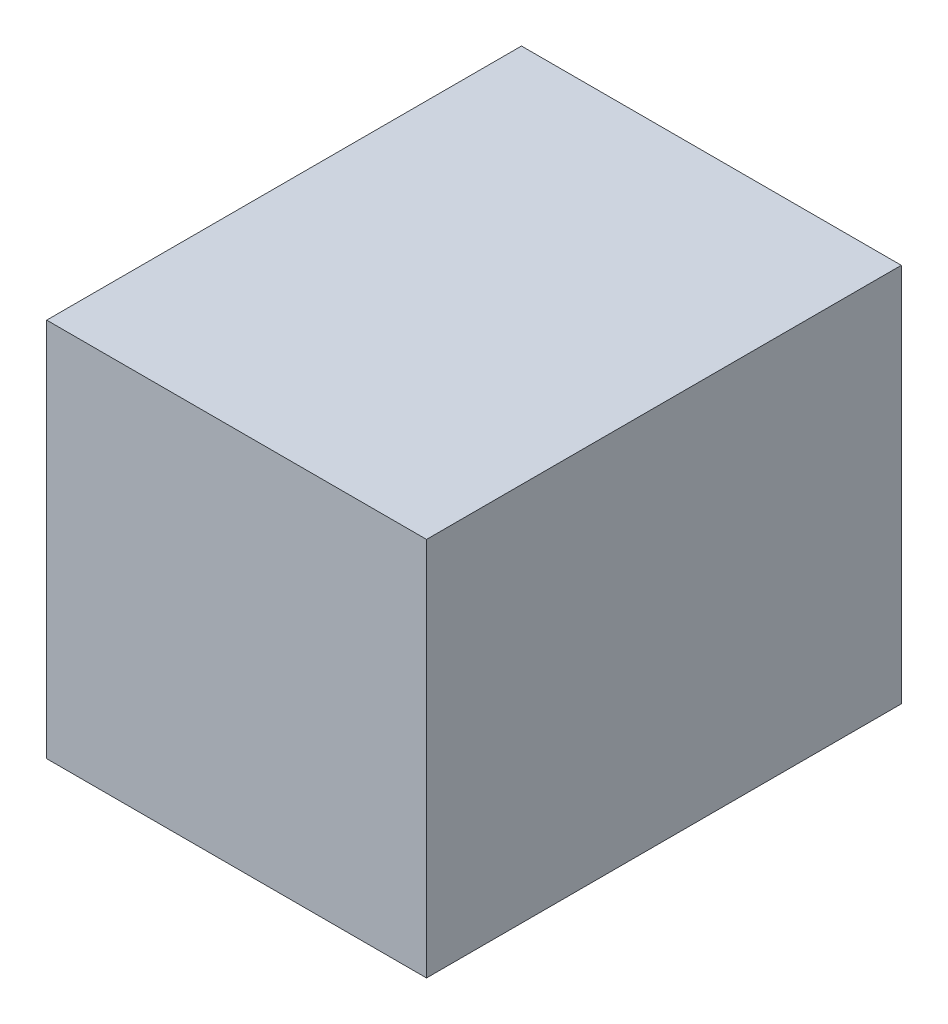
ISO-10303-21;
HEADER;
FILE_DESCRIPTION(('STEP AP214'),'2;1');
FILE_NAME('part.step','',(''),(''),'','','');
FILE_SCHEMA(('AUTOMOTIVE_DESIGN { 1 0 10303 214 1 1 1 1 }'));
ENDSEC;
DATA;
#1=APPLICATION_CONTEXT('core data for automotive mechanical design processes');
#2=APPLICATION_PROTOCOL_DEFINITION('international standard','automotive_design',2000,#1);
#3=PRODUCT_CONTEXT('',#1,'mechanical');
#4=PRODUCT('Part','Part','',(#3));
#5=PRODUCT_RELATED_PRODUCT_CATEGORY('part','',(#4));
#6=PRODUCT_DEFINITION_FORMATION('','',#4);
#7=PRODUCT_DEFINITION_CONTEXT('part definition',#1,'design');
#8=PRODUCT_DEFINITION('design','',#6,#7);
#9=PRODUCT_DEFINITION_SHAPE('','',#8);
#10=(LENGTH_UNIT() NAMED_UNIT(*) SI_UNIT(.MILLI.,.METRE.));
#11=(NAMED_UNIT(*) PLANE_ANGLE_UNIT() SI_UNIT($,.RADIAN.));
#12=(NAMED_UNIT(*) SI_UNIT($,.STERADIAN.) SOLID_ANGLE_UNIT());
#13=UNCERTAINTY_MEASURE_WITH_UNIT(LENGTH_MEASURE(1.E-05),#10,'distance_accuracy_value','');
#14=(GEOMETRIC_REPRESENTATION_CONTEXT(3) GLOBAL_UNCERTAINTY_ASSIGNED_CONTEXT((#13)) GLOBAL_UNIT_ASSIGNED_CONTEXT((#10,
#11,#12)) REPRESENTATION_CONTEXT('',''));
#15=CARTESIAN_POINT('',(0.,0.,0.));
#16=DIRECTION('',(0.,0.,1.));
#17=DIRECTION('',(1.,0.,0.));
#18=AXIS2_PLACEMENT_3D('',#15,#16,#17);
#19=CARTESIAN_POINT('',(0.4,0.8,-0.5));
#20=DIRECTION('',(-1.,0.,0.));
#21=DIRECTION('',(0.,0.,1.));
#22=AXIS2_PLACEMENT_3D('',#19,#20,#21);
#23=PLANE('',#22);
#24=DIRECTION('',(0.,0.,-1.));
#25=VECTOR('',#24,1.);
#26=CARTESIAN_POINT('',(0.4,0.,-0.5));
#27=LINE('',#26,#25);
#28=CARTESIAN_POINT('',(0.4,0.,0.5));
#29=VERTEX_POINT('',#28);
#30=CARTESIAN_POINT('',(0.4,0.,-0.5));
#31=VERTEX_POINT('',#30);
#32=EDGE_CURVE('E96',#29,#31,#27,.T.);
#33=ORIENTED_EDGE('',*,*,#32,.T.);
#34=DIRECTION('',(0.,-1.,0.));
#35=VECTOR('',#34,1.);
#36=CARTESIAN_POINT('',(0.4,0.8,-0.5));
#37=LINE('',#36,#35);
#38=CARTESIAN_POINT('',(0.4,0.8,-0.5));
#39=VERTEX_POINT('',#38);
#40=EDGE_CURVE('E11',#39,#31,#37,.T.);
#41=ORIENTED_EDGE('',*,*,#40,.F.);
#42=DIRECTION('',(0.,0.,-1.));
#43=VECTOR('',#42,1.);
#44=CARTESIAN_POINT('',(0.4,0.8,-0.5));
#45=LINE('',#44,#43);
#46=CARTESIAN_POINT('',(0.4,0.8,0.5));
#47=VERTEX_POINT('',#46);
#48=EDGE_CURVE('E84',#47,#39,#45,.T.);
#49=ORIENTED_EDGE('',*,*,#48,.F.);
#50=DIRECTION('',(0.,-1.,0.));
#51=VECTOR('',#50,1.);
#52=CARTESIAN_POINT('',(0.4,0.8,0.5));
#53=LINE('',#52,#51);
#54=EDGE_CURVE('E92',#47,#29,#53,.T.);
#55=ORIENTED_EDGE('',*,*,#54,.T.);
#56=EDGE_LOOP('',(#33,#41,#49,#55));
#57=FACE_BOUND('',#56,.T.);
#58=ADVANCED_FACE('F33',(#57),#23,.F.);
#59=CARTESIAN_POINT('',(-0.4,0.8,-0.5));
#60=DIRECTION('',(0.,0.,1.));
#61=DIRECTION('',(1.,0.,0.));
#62=AXIS2_PLACEMENT_3D('',#59,#60,#61);
#63=PLANE('',#62);
#64=DIRECTION('',(-1.,0.,0.));
#65=VECTOR('',#64,1.);
#66=CARTESIAN_POINT('',(-0.4,0.,-0.5));
#67=LINE('',#66,#65);
#68=CARTESIAN_POINT('',(-0.4,0.,-0.5));
#69=VERTEX_POINT('',#68);
#70=EDGE_CURVE('E88',#31,#69,#67,.T.);
#71=ORIENTED_EDGE('',*,*,#70,.T.);
#72=DIRECTION('',(0.,-1.,0.));
#73=VECTOR('',#72,1.);
#74=CARTESIAN_POINT('',(-0.4,0.8,-0.5));
#75=LINE('',#74,#73);
#76=CARTESIAN_POINT('',(-0.4,0.8,-0.5));
#77=VERTEX_POINT('',#76);
#78=EDGE_CURVE('E41',#77,#69,#75,.T.);
#79=ORIENTED_EDGE('',*,*,#78,.F.);
#80=DIRECTION('',(-1.,0.,0.));
#81=VECTOR('',#80,1.);
#82=CARTESIAN_POINT('',(-0.4,0.8,-0.5));
#83=LINE('',#82,#81);
#84=EDGE_CURVE('E79',#39,#77,#83,.T.);
#85=ORIENTED_EDGE('',*,*,#84,.F.);
#86=ORIENTED_EDGE('',*,*,#40,.T.);
#87=EDGE_LOOP('',(#71,#79,#85,#86));
#88=FACE_BOUND('',#87,.T.);
#89=ADVANCED_FACE('F87',(#88),#63,.F.);
#90=CARTESIAN_POINT('',(-0.4,0.8,-0.5));
#91=DIRECTION('',(1.,0.,0.));
#92=DIRECTION('',(0.,0.,-1.));
#93=AXIS2_PLACEMENT_3D('',#90,#91,#92);
#94=PLANE('',#93);
#95=DIRECTION('',(0.,0.,1.));
#96=VECTOR('',#95,1.);
#97=CARTESIAN_POINT('',(-0.4,0.,-0.5));
#98=LINE('',#97,#96);
#99=CARTESIAN_POINT('',(-0.4,0.,0.5));
#100=VERTEX_POINT('',#99);
#101=EDGE_CURVE('E66',#69,#100,#98,.T.);
#102=ORIENTED_EDGE('',*,*,#101,.T.);
#103=DIRECTION('',(0.,-1.,0.));
#104=VECTOR('',#103,1.);
#105=CARTESIAN_POINT('',(-0.4,0.8,0.5));
#106=LINE('',#105,#104);
#107=CARTESIAN_POINT('',(-0.4,0.8,0.5));
#108=VERTEX_POINT('',#107);
#109=EDGE_CURVE('E89',#108,#100,#106,.T.);
#110=ORIENTED_EDGE('',*,*,#109,.F.);
#111=DIRECTION('',(0.,0.,1.));
#112=VECTOR('',#111,1.);
#113=CARTESIAN_POINT('',(-0.4,0.8,-0.5));
#114=LINE('',#113,#112);
#115=EDGE_CURVE('E82',#77,#108,#114,.T.);
#116=ORIENTED_EDGE('',*,*,#115,.F.);
#117=ORIENTED_EDGE('',*,*,#78,.T.);
#118=EDGE_LOOP('',(#102,#110,#116,#117));
#119=FACE_BOUND('',#118,.T.);
#120=ADVANCED_FACE('F90',(#119),#94,.F.);
#121=CARTESIAN_POINT('',(-0.4,0.8,0.5));
#122=DIRECTION('',(0.,0.,-1.));
#123=DIRECTION('',(-1.,0.,0.));
#124=AXIS2_PLACEMENT_3D('',#121,#122,#123);
#125=PLANE('',#124);
#126=DIRECTION('',(1.,0.,0.));
#127=VECTOR('',#126,1.);
#128=CARTESIAN_POINT('',(-0.4,0.,0.5));
#129=LINE('',#128,#127);
#130=EDGE_CURVE('E72',#100,#29,#129,.T.);
#131=ORIENTED_EDGE('',*,*,#130,.T.);
#132=ORIENTED_EDGE('',*,*,#54,.F.);
#133=DIRECTION('',(1.,0.,0.));
#134=VECTOR('',#133,1.);
#135=CARTESIAN_POINT('',(-0.4,0.8,0.5));
#136=LINE('',#135,#134);
#137=EDGE_CURVE('E49',#108,#47,#136,.T.);
#138=ORIENTED_EDGE('',*,*,#137,.F.);
#139=ORIENTED_EDGE('',*,*,#109,.T.);
#140=EDGE_LOOP('',(#131,#132,#138,#139));
#141=FACE_BOUND('',#140,.T.);
#142=ADVANCED_FACE('F103',(#141),#125,.F.);
#143=CARTESIAN_POINT('',(0.,0.8,0.));
#144=DIRECTION('',(0.,1.,0.));
#145=DIRECTION('',(0.,0.,1.));
#146=AXIS2_PLACEMENT_3D('',#143,#144,#145);
#147=PLANE('',#146);
#148=ORIENTED_EDGE('',*,*,#48,.T.);
#149=ORIENTED_EDGE('',*,*,#84,.T.);
#150=ORIENTED_EDGE('',*,*,#115,.T.);
#151=ORIENTED_EDGE('',*,*,#137,.T.);
#152=EDGE_LOOP('',(#148,#149,#150,#151));
#153=FACE_BOUND('',#152,.T.);
#154=ADVANCED_FACE('F80',(#153),#147,.T.);
#155=CARTESIAN_POINT('',(0.,0.,0.));
#156=DIRECTION('',(0.,1.,0.));
#157=DIRECTION('',(0.,0.,1.));
#158=AXIS2_PLACEMENT_3D('',#155,#156,#157);
#159=PLANE('',#158);
#160=ORIENTED_EDGE('',*,*,#32,.F.);
#161=ORIENTED_EDGE('',*,*,#130,.F.);
#162=ORIENTED_EDGE('',*,*,#101,.F.);
#163=ORIENTED_EDGE('',*,*,#70,.F.);
#164=EDGE_LOOP('',(#160,#161,#162,#163));
#165=FACE_BOUND('',#164,.T.);
#166=ADVANCED_FACE('F106',(#165),#159,.F.);
#167=CLOSED_SHELL('',(#58,#89,#120,#142,#154,#166));
#168=MANIFOLD_SOLID_BREP('B2',#167);
#169=ADVANCED_BREP_SHAPE_REPRESENTATION('',(#18,#168),#14);
#170=SHAPE_DEFINITION_REPRESENTATION(#9,#169);
ENDSEC;
END-ISO-10303-21;
